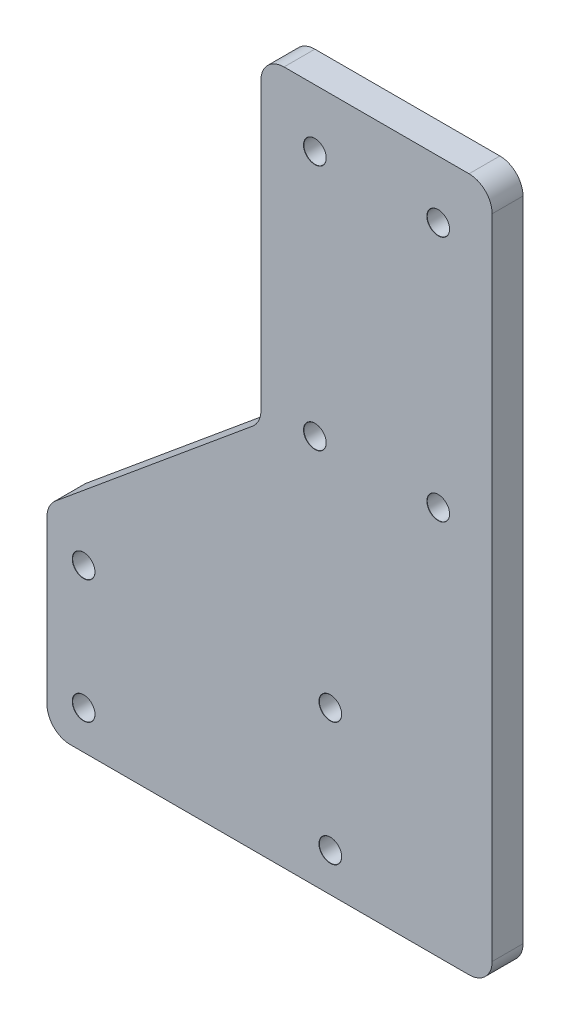
ISO-10303-21;
HEADER;
FILE_DESCRIPTION(('STEP AP214'),'2;1');
FILE_NAME('part.step','',(''),(''),'','','');
FILE_SCHEMA(('AUTOMOTIVE_DESIGN { 1 0 10303 214 1 1 1 1 }'));
ENDSEC;
DATA;
#1=APPLICATION_CONTEXT('core data for automotive mechanical design processes');
#2=APPLICATION_PROTOCOL_DEFINITION('international standard','automotive_design',2000,#1);
#3=PRODUCT_CONTEXT('',#1,'mechanical');
#4=PRODUCT('Part','Part','',(#3));
#5=PRODUCT_RELATED_PRODUCT_CATEGORY('part','',(#4));
#6=PRODUCT_DEFINITION_FORMATION('','',#4);
#7=PRODUCT_DEFINITION_CONTEXT('part definition',#1,'design');
#8=PRODUCT_DEFINITION('design','',#6,#7);
#9=PRODUCT_DEFINITION_SHAPE('','',#8);
#10=(LENGTH_UNIT() NAMED_UNIT(*) SI_UNIT(.MILLI.,.METRE.));
#11=(NAMED_UNIT(*) PLANE_ANGLE_UNIT() SI_UNIT($,.RADIAN.));
#12=(NAMED_UNIT(*) SI_UNIT($,.STERADIAN.) SOLID_ANGLE_UNIT());
#13=UNCERTAINTY_MEASURE_WITH_UNIT(LENGTH_MEASURE(1.E-05),#10,'distance_accuracy_value','');
#14=(GEOMETRIC_REPRESENTATION_CONTEXT(3) GLOBAL_UNCERTAINTY_ASSIGNED_CONTEXT((#13)) GLOBAL_UNIT_ASSIGNED_CONTEXT((#10,
#11,#12)) REPRESENTATION_CONTEXT('',''));
#15=CARTESIAN_POINT('',(0.,0.,0.));
#16=DIRECTION('',(0.,0.,1.));
#17=DIRECTION('',(1.,0.,0.));
#18=AXIS2_PLACEMENT_3D('',#15,#16,#17);
#19=CARTESIAN_POINT('',(16.2499999999986,90.,4.));
#20=DIRECTION('',(-1.,0.,0.));
#21=DIRECTION('',(0.,-1.,0.));
#22=AXIS2_PLACEMENT_3D('',#19,#20,#21);
#23=PLANE('',#22);
#24=DIRECTION('',(0.,1.,0.));
#25=VECTOR('',#24,1.);
#26=CARTESIAN_POINT('',(16.2499999999986,90.,4.));
#27=LINE('',#26,#25);
#28=CARTESIAN_POINT('',(16.2499999999987,3.00000000000003,4.));
#29=VERTEX_POINT('',#28);
#30=CARTESIAN_POINT('',(16.2499999999986,87.,4.));
#31=VERTEX_POINT('',#30);
#32=EDGE_CURVE('E150',#29,#31,#27,.T.);
#33=ORIENTED_EDGE('',*,*,#32,.F.);
#34=DIRECTION('',(0.,0.,-1.));
#35=VECTOR('',#34,1.);
#36=CARTESIAN_POINT('',(16.2499999999987,3.,4.));
#37=LINE('',#36,#35);
#38=CARTESIAN_POINT('',(16.2499999999987,3.00000000000003,0.));
#39=VERTEX_POINT('',#38);
#40=EDGE_CURVE('E135',#29,#39,#37,.T.);
#41=ORIENTED_EDGE('',*,*,#40,.T.);
#42=DIRECTION('',(0.,1.,0.));
#43=VECTOR('',#42,1.);
#44=CARTESIAN_POINT('',(16.2499999999986,90.,0.));
#45=LINE('',#44,#43);
#46=CARTESIAN_POINT('',(16.2499999999986,87.,0.));
#47=VERTEX_POINT('',#46);
#48=EDGE_CURVE('E147',#39,#47,#45,.T.);
#49=ORIENTED_EDGE('',*,*,#48,.T.);
#50=DIRECTION('',(0.,0.,-1.));
#51=VECTOR('',#50,1.);
#52=CARTESIAN_POINT('',(16.2499999999986,87.,4.));
#53=LINE('',#52,#51);
#54=EDGE_CURVE('E152',#47,#31,#53,.F.);
#55=ORIENTED_EDGE('',*,*,#54,.T.);
#56=EDGE_LOOP('',(#33,#41,#49,#55));
#57=FACE_BOUND('',#56,.T.);
#58=ADVANCED_FACE('F41',(#57),#23,.F.);
#59=CARTESIAN_POINT('',(-13.7500000000013,90.,4.));
#60=DIRECTION('',(0.,-1.,0.));
#61=DIRECTION('',(0.,0.,-1.));
#62=AXIS2_PLACEMENT_3D('',#59,#60,#61);
#63=PLANE('',#62);
#64=DIRECTION('',(-1.,0.,0.));
#65=VECTOR('',#64,1.);
#66=CARTESIAN_POINT('',(-13.7500000000013,90.,0.));
#67=LINE('',#66,#65);
#68=CARTESIAN_POINT('',(13.2499999999987,90.,0.));
#69=VERTEX_POINT('',#68);
#70=CARTESIAN_POINT('',(-10.7500000000013,90.,0.));
#71=VERTEX_POINT('',#70);
#72=EDGE_CURVE('E156',#69,#71,#67,.T.);
#73=ORIENTED_EDGE('',*,*,#72,.T.);
#74=DIRECTION('',(0.,0.,-1.));
#75=VECTOR('',#74,1.);
#76=CARTESIAN_POINT('',(-10.7500000000013,90.,4.));
#77=LINE('',#76,#75);
#78=CARTESIAN_POINT('',(-10.7500000000013,90.,4.));
#79=VERTEX_POINT('',#78);
#80=EDGE_CURVE('E215',#71,#79,#77,.F.);
#81=ORIENTED_EDGE('',*,*,#80,.T.);
#82=DIRECTION('',(-1.,0.,0.));
#83=VECTOR('',#82,1.);
#84=CARTESIAN_POINT('',(-13.7500000000013,90.,4.));
#85=LINE('',#84,#83);
#86=CARTESIAN_POINT('',(13.2499999999987,90.,4.));
#87=VERTEX_POINT('',#86);
#88=EDGE_CURVE('E236',#87,#79,#85,.T.);
#89=ORIENTED_EDGE('',*,*,#88,.F.);
#90=DIRECTION('',(0.,0.,-1.));
#91=VECTOR('',#90,1.);
#92=CARTESIAN_POINT('',(13.2499999999987,90.,4.));
#93=LINE('',#92,#91);
#94=EDGE_CURVE('E212',#87,#69,#93,.T.);
#95=ORIENTED_EDGE('',*,*,#94,.T.);
#96=EDGE_LOOP('',(#73,#81,#89,#95));
#97=FACE_BOUND('',#96,.T.);
#98=ADVANCED_FACE('F349',(#97),#63,.F.);
#99=CARTESIAN_POINT('',(-13.7500000000013,48.5,4.));
#100=DIRECTION('',(1.,0.,0.));
#101=DIRECTION('',(0.,0.,-1.));
#102=AXIS2_PLACEMENT_3D('',#99,#100,#101);
#103=PLANE('',#102);
#104=DIRECTION('',(0.,-1.,0.));
#105=VECTOR('',#104,1.);
#106=CARTESIAN_POINT('',(-13.7500000000013,48.5,0.));
#107=LINE('',#106,#105);
#108=CARTESIAN_POINT('',(-13.7500000000013,87.,0.));
#109=VERTEX_POINT('',#108);
#110=CARTESIAN_POINT('',(-13.7500000000013,49.9100010404382,0.));
#111=VERTEX_POINT('',#110);
#112=EDGE_CURVE('E160',#109,#111,#107,.T.);
#113=ORIENTED_EDGE('',*,*,#112,.T.);
#114=DIRECTION('',(0.,0.,-1.));
#115=VECTOR('',#114,1.);
#116=CARTESIAN_POINT('',(-13.7500000000013,49.9100010404382,4.));
#117=LINE('',#116,#115);
#118=CARTESIAN_POINT('',(-13.7500000000013,49.9100010404382,4.));
#119=VERTEX_POINT('',#118);
#120=EDGE_CURVE('E210',#111,#119,#117,.F.);
#121=ORIENTED_EDGE('',*,*,#120,.T.);
#122=DIRECTION('',(0.,-1.,0.));
#123=VECTOR('',#122,1.);
#124=CARTESIAN_POINT('',(-13.7500000000013,48.5,4.));
#125=LINE('',#124,#123);
#126=CARTESIAN_POINT('',(-13.7500000000013,87.,4.));
#127=VERTEX_POINT('',#126);
#128=EDGE_CURVE('E232',#127,#119,#125,.T.);
#129=ORIENTED_EDGE('',*,*,#128,.F.);
#130=DIRECTION('',(0.,0.,-1.));
#131=VECTOR('',#130,1.);
#132=CARTESIAN_POINT('',(-13.7500000000013,87.,4.));
#133=LINE('',#132,#131);
#134=EDGE_CURVE('E207',#127,#109,#133,.T.);
#135=ORIENTED_EDGE('',*,*,#134,.T.);
#136=EDGE_LOOP('',(#113,#121,#129,#135));
#137=FACE_BOUND('',#136,.T.);
#138=ADVANCED_FACE('F222',(#137),#103,.F.);
#139=CARTESIAN_POINT('',(-41.5,25.5,4.));
#140=DIRECTION('',(0.638135364043884,-0.769924189226822,0.));
#141=DIRECTION('',(0.769924189226822,0.638135364043884,0.));
#142=AXIS2_PLACEMENT_3D('',#139,#140,#141);
#143=PLANE('',#142);
#144=DIRECTION('',(-0.769924189226822,-0.638135364043884,0.));
#145=VECTOR('',#144,1.);
#146=CARTESIAN_POINT('',(-41.5,25.5,0.));
#147=LINE('',#146,#145);
#148=CARTESIAN_POINT('',(-14.8355939078697,47.6002284727577,0.));
#149=VERTEX_POINT('',#148);
#150=CARTESIAN_POINT('',(-40.4144060921316,26.3997715272423,0.));
#151=VERTEX_POINT('',#150);
#152=EDGE_CURVE('E171',#149,#151,#147,.T.);
#153=ORIENTED_EDGE('',*,*,#152,.T.);
#154=DIRECTION('',(0.,0.,-1.));
#155=VECTOR('',#154,1.);
#156=CARTESIAN_POINT('',(-40.4144060921316,26.3997715272423,4.));
#157=LINE('',#156,#155);
#158=CARTESIAN_POINT('',(-40.4144060921316,26.3997715272423,4.));
#159=VERTEX_POINT('',#158);
#160=EDGE_CURVE('E205',#151,#159,#157,.F.);
#161=ORIENTED_EDGE('',*,*,#160,.T.);
#162=DIRECTION('',(-0.769924189226822,-0.638135364043884,0.));
#163=VECTOR('',#162,1.);
#164=CARTESIAN_POINT('',(-41.5,25.5,4.));
#165=LINE('',#164,#163);
#166=CARTESIAN_POINT('',(-14.8355939078697,47.6002284727577,4.));
#167=VERTEX_POINT('',#166);
#168=EDGE_CURVE('E231',#167,#159,#165,.T.);
#169=ORIENTED_EDGE('',*,*,#168,.F.);
#170=DIRECTION('',(0.,0.,-1.));
#171=VECTOR('',#170,1.);
#172=CARTESIAN_POINT('',(-14.8355939078697,47.6002284727577,0.));
#173=LINE('',#172,#171);
#174=EDGE_CURVE('E202',#167,#149,#173,.T.);
#175=ORIENTED_EDGE('',*,*,#174,.T.);
#176=EDGE_LOOP('',(#153,#161,#169,#175));
#177=FACE_BOUND('',#176,.T.);
#178=ADVANCED_FACE('F234',(#177),#143,.F.);
#179=CARTESIAN_POINT('',(-41.5,0.,4.));
#180=DIRECTION('',(1.,0.,0.));
#181=DIRECTION('',(0.,0.,-1.));
#182=AXIS2_PLACEMENT_3D('',#179,#180,#181);
#183=PLANE('',#182);
#184=DIRECTION('',(0.,-1.,0.));
#185=VECTOR('',#184,1.);
#186=CARTESIAN_POINT('',(-41.5,0.,0.));
#187=LINE('',#186,#185);
#188=CARTESIAN_POINT('',(-41.5,24.0899989595618,0.));
#189=VERTEX_POINT('',#188);
#190=CARTESIAN_POINT('',(-41.5,3.,0.));
#191=VERTEX_POINT('',#190);
#192=EDGE_CURVE('E174',#189,#191,#187,.T.);
#193=ORIENTED_EDGE('',*,*,#192,.T.);
#194=DIRECTION('',(0.,0.,-1.));
#195=VECTOR('',#194,1.);
#196=CARTESIAN_POINT('',(-41.5,3.,4.));
#197=LINE('',#196,#195);
#198=CARTESIAN_POINT('',(-41.5,3.,4.));
#199=VERTEX_POINT('',#198);
#200=EDGE_CURVE('E56',#191,#199,#197,.F.);
#201=ORIENTED_EDGE('',*,*,#200,.T.);
#202=DIRECTION('',(0.,-1.,0.));
#203=VECTOR('',#202,1.);
#204=CARTESIAN_POINT('',(-41.5,0.,4.));
#205=LINE('',#204,#203);
#206=CARTESIAN_POINT('',(-41.5,24.0899989595618,4.));
#207=VERTEX_POINT('',#206);
#208=EDGE_CURVE('E166',#207,#199,#205,.T.);
#209=ORIENTED_EDGE('',*,*,#208,.F.);
#210=DIRECTION('',(0.,0.,-1.));
#211=VECTOR('',#210,1.);
#212=CARTESIAN_POINT('',(-41.5,24.0899989595618,4.));
#213=LINE('',#212,#211);
#214=EDGE_CURVE('E198',#207,#189,#213,.T.);
#215=ORIENTED_EDGE('',*,*,#214,.T.);
#216=EDGE_LOOP('',(#193,#201,#209,#215));
#217=FACE_BOUND('',#216,.T.);
#218=ADVANCED_FACE('F387',(#217),#183,.F.);
#219=CARTESIAN_POINT('',(0.,0.,4.));
#220=DIRECTION('',(0.,1.,0.));
#221=DIRECTION('',(-1.,0.,0.));
#222=AXIS2_PLACEMENT_3D('',#219,#220,#221);
#223=PLANE('',#222);
#224=DIRECTION('',(1.,0.,0.));
#225=VECTOR('',#224,1.);
#226=CARTESIAN_POINT('',(0.,0.,0.));
#227=LINE('',#226,#225);
#228=CARTESIAN_POINT('',(-38.5,0.,0.));
#229=VERTEX_POINT('',#228);
#230=CARTESIAN_POINT('',(13.2499999999987,0.,0.));
#231=VERTEX_POINT('',#230);
#232=EDGE_CURVE('E176',#229,#231,#227,.T.);
#233=ORIENTED_EDGE('',*,*,#232,.T.);
#234=DIRECTION('',(0.,0.,-1.));
#235=VECTOR('',#234,1.);
#236=CARTESIAN_POINT('',(13.2499999999987,0.,4.));
#237=LINE('',#236,#235);
#238=CARTESIAN_POINT('',(13.2499999999987,0.,4.));
#239=VERTEX_POINT('',#238);
#240=EDGE_CURVE('E136',#231,#239,#237,.F.);
#241=ORIENTED_EDGE('',*,*,#240,.T.);
#242=DIRECTION('',(1.,0.,0.));
#243=VECTOR('',#242,1.);
#244=CARTESIAN_POINT('',(0.,0.,4.));
#245=LINE('',#244,#243);
#246=CARTESIAN_POINT('',(-38.5,0.,4.));
#247=VERTEX_POINT('',#246);
#248=EDGE_CURVE('E178',#247,#239,#245,.T.);
#249=ORIENTED_EDGE('',*,*,#248,.F.);
#250=DIRECTION('',(0.,0.,-1.));
#251=VECTOR('',#250,1.);
#252=CARTESIAN_POINT('',(-38.5,0.,4.));
#253=LINE('',#252,#251);
#254=EDGE_CURVE('E141',#247,#229,#253,.T.);
#255=ORIENTED_EDGE('',*,*,#254,.T.);
#256=EDGE_LOOP('',(#233,#241,#249,#255));
#257=FACE_BOUND('',#256,.T.);
#258=ADVANCED_FACE('F316',(#257),#223,.F.);
#259=CARTESIAN_POINT('',(0.,0.,4.));
#260=DIRECTION('',(0.,0.,-1.));
#261=DIRECTION('',(-1.,0.,0.));
#262=AXIS2_PLACEMENT_3D('',#259,#260,#261);
#263=PLANE('',#262);
#264=CARTESIAN_POINT('',(-36.75,5.,4.));
#265=DIRECTION('',(0.,0.,1.));
#266=DIRECTION('',(1.,0.,0.));
#267=AXIS2_PLACEMENT_3D('',#264,#265,#266);
#268=CIRCLE('',#267,1.475);
#269=CARTESIAN_POINT('',(-35.275,5.,4.));
#270=VERTEX_POINT('',#269);
#271=EDGE_CURVE('E308',#270,#270,#268,.T.);
#272=ORIENTED_EDGE('',*,*,#271,.F.);
#273=EDGE_LOOP('',(#272));
#274=FACE_BOUND('',#273,.T.);
#275=CARTESIAN_POINT('',(-36.75,21.,4.));
#276=DIRECTION('',(0.,0.,1.));
#277=DIRECTION('',(1.,0.,0.));
#278=AXIS2_PLACEMENT_3D('',#275,#276,#277);
#279=CIRCLE('',#278,1.475);
#280=CARTESIAN_POINT('',(-35.275,21.,4.));
#281=VERTEX_POINT('',#280);
#282=EDGE_CURVE('E299',#281,#281,#279,.T.);
#283=ORIENTED_EDGE('',*,*,#282,.F.);
#284=EDGE_LOOP('',(#283));
#285=FACE_BOUND('',#284,.T.);
#286=CARTESIAN_POINT('',(-4.75,5.,4.));
#287=DIRECTION('',(0.,0.,1.));
#288=DIRECTION('',(1.,0.,0.));
#289=AXIS2_PLACEMENT_3D('',#286,#287,#288);
#290=CIRCLE('',#289,1.475);
#291=CARTESIAN_POINT('',(-3.275,5.,4.));
#292=VERTEX_POINT('',#291);
#293=EDGE_CURVE('E290',#292,#292,#290,.T.);
#294=ORIENTED_EDGE('',*,*,#293,.F.);
#295=EDGE_LOOP('',(#294));
#296=FACE_BOUND('',#295,.T.);
#297=CARTESIAN_POINT('',(-4.74999999999999,21.,4.));
#298=DIRECTION('',(0.,0.,1.));
#299=DIRECTION('',(1.,0.,0.));
#300=AXIS2_PLACEMENT_3D('',#297,#298,#299);
#301=CIRCLE('',#300,1.475);
#302=CARTESIAN_POINT('',(-3.27499999999999,21.,4.));
#303=VERTEX_POINT('',#302);
#304=EDGE_CURVE('E281',#303,#303,#301,.T.);
#305=ORIENTED_EDGE('',*,*,#304,.F.);
#306=EDGE_LOOP('',(#305));
#307=FACE_BOUND('',#306,.T.);
#308=CARTESIAN_POINT('',(-6.75000000000004,82.5,4.));
#309=DIRECTION('',(0.,0.,1.));
#310=DIRECTION('',(1.,0.,0.));
#311=AXIS2_PLACEMENT_3D('',#308,#309,#310);
#312=CIRCLE('',#311,1.475);
#313=CARTESIAN_POINT('',(-5.27500000000004,82.5,4.));
#314=VERTEX_POINT('',#313);
#315=EDGE_CURVE('E272',#314,#314,#312,.T.);
#316=ORIENTED_EDGE('',*,*,#315,.F.);
#317=EDGE_LOOP('',(#316));
#318=FACE_BOUND('',#317,.T.);
#319=CARTESIAN_POINT('',(9.24999999999996,82.5,4.));
#320=DIRECTION('',(0.,0.,1.));
#321=DIRECTION('',(1.,0.,0.));
#322=AXIS2_PLACEMENT_3D('',#319,#320,#321);
#323=CIRCLE('',#322,1.475);
#324=CARTESIAN_POINT('',(10.725,82.5,4.));
#325=VERTEX_POINT('',#324);
#326=EDGE_CURVE('E263',#325,#325,#323,.T.);
#327=ORIENTED_EDGE('',*,*,#326,.F.);
#328=EDGE_LOOP('',(#327));
#329=FACE_BOUND('',#328,.T.);
#330=CARTESIAN_POINT('',(-6.75000000000003,50.5,4.));
#331=DIRECTION('',(0.,0.,1.));
#332=DIRECTION('',(1.,0.,0.));
#333=AXIS2_PLACEMENT_3D('',#330,#331,#332);
#334=CIRCLE('',#333,1.475);
#335=CARTESIAN_POINT('',(-5.27500000000003,50.5,4.));
#336=VERTEX_POINT('',#335);
#337=EDGE_CURVE('E254',#336,#336,#334,.T.);
#338=ORIENTED_EDGE('',*,*,#337,.F.);
#339=EDGE_LOOP('',(#338));
#340=FACE_BOUND('',#339,.T.);
#341=CARTESIAN_POINT('',(9.24999999999997,50.5,4.));
#342=DIRECTION('',(0.,0.,1.));
#343=DIRECTION('',(1.,0.,0.));
#344=AXIS2_PLACEMENT_3D('',#341,#342,#343);
#345=CIRCLE('',#344,1.475);
#346=CARTESIAN_POINT('',(10.725,50.5,4.));
#347=VERTEX_POINT('',#346);
#348=EDGE_CURVE('E245',#347,#347,#345,.T.);
#349=ORIENTED_EDGE('',*,*,#348,.F.);
#350=EDGE_LOOP('',(#349));
#351=FACE_BOUND('',#350,.T.);
#352=ORIENTED_EDGE('',*,*,#248,.T.);
#353=CARTESIAN_POINT('',(13.2499999999987,3.,4.));
#354=DIRECTION('',(0.,0.,-1.));
#355=DIRECTION('',(-1.,0.,0.));
#356=AXIS2_PLACEMENT_3D('',#353,#354,#355);
#357=CIRCLE('',#356,3.);
#358=EDGE_CURVE('E196',#239,#29,#357,.F.);
#359=ORIENTED_EDGE('',*,*,#358,.T.);
#360=ORIENTED_EDGE('',*,*,#32,.T.);
#361=CARTESIAN_POINT('',(13.2499999999987,87.,4.));
#362=DIRECTION('',(0.,0.,-1.));
#363=DIRECTION('',(-1.,0.,0.));
#364=AXIS2_PLACEMENT_3D('',#361,#362,#363);
#365=CIRCLE('',#364,3.);
#366=EDGE_CURVE('E189',#31,#87,#365,.F.);
#367=ORIENTED_EDGE('',*,*,#366,.T.);
#368=ORIENTED_EDGE('',*,*,#88,.T.);
#369=CARTESIAN_POINT('',(-10.7500000000013,87.,4.));
#370=DIRECTION('',(0.,0.,-1.));
#371=DIRECTION('',(-1.,0.,0.));
#372=AXIS2_PLACEMENT_3D('',#369,#370,#371);
#373=CIRCLE('',#372,3.);
#374=EDGE_CURVE('E191',#79,#127,#373,.F.);
#375=ORIENTED_EDGE('',*,*,#374,.T.);
#376=ORIENTED_EDGE('',*,*,#128,.T.);
#377=CARTESIAN_POINT('',(-16.7500000000014,49.9100010404382,4.));
#378=DIRECTION('',(0.,0.,-1.));
#379=DIRECTION('',(-1.,0.,0.));
#380=AXIS2_PLACEMENT_3D('',#377,#378,#379);
#381=CIRCLE('',#380,3.);
#382=EDGE_CURVE('E11',#119,#167,#381,.T.);
#383=ORIENTED_EDGE('',*,*,#382,.T.);
#384=ORIENTED_EDGE('',*,*,#168,.T.);
#385=CARTESIAN_POINT('',(-38.5,24.0899989595618,4.));
#386=DIRECTION('',(0.,0.,-1.));
#387=DIRECTION('',(-1.,0.,0.));
#388=AXIS2_PLACEMENT_3D('',#385,#386,#387);
#389=CIRCLE('',#388,3.);
#390=EDGE_CURVE('E63',#159,#207,#389,.F.);
#391=ORIENTED_EDGE('',*,*,#390,.T.);
#392=ORIENTED_EDGE('',*,*,#208,.T.);
#393=CARTESIAN_POINT('',(-38.5,3.,4.));
#394=DIRECTION('',(0.,0.,-1.));
#395=DIRECTION('',(-1.,0.,0.));
#396=AXIS2_PLACEMENT_3D('',#393,#394,#395);
#397=CIRCLE('',#396,3.);
#398=EDGE_CURVE('E194',#199,#247,#397,.F.);
#399=ORIENTED_EDGE('',*,*,#398,.T.);
#400=EDGE_LOOP('',(#352,#359,#360,#367,#368,#375,#376,#383,#384,#391,#392,#399));
#401=FACE_BOUND('',#400,.T.);
#402=ADVANCED_FACE('F230',(#274,#285,#296,#307,#318,#329,#340,#351,#401),#263,.F.);
#403=CARTESIAN_POINT('',(0.,0.,0.));
#404=DIRECTION('',(0.,0.,-1.));
#405=DIRECTION('',(-1.,0.,0.));
#406=AXIS2_PLACEMENT_3D('',#403,#404,#405);
#407=PLANE('',#406);
#408=CARTESIAN_POINT('',(-36.75,5.,0.));
#409=DIRECTION('',(0.,0.,1.));
#410=DIRECTION('',(1.,0.,0.));
#411=AXIS2_PLACEMENT_3D('',#408,#409,#410);
#412=CIRCLE('',#411,1.45);
#413=CARTESIAN_POINT('',(-35.3,5.,0.));
#414=VERTEX_POINT('',#413);
#415=EDGE_CURVE('E302',#414,#414,#412,.T.);
#416=ORIENTED_EDGE('',*,*,#415,.T.);
#417=EDGE_LOOP('',(#416));
#418=FACE_BOUND('',#417,.T.);
#419=CARTESIAN_POINT('',(-36.75,21.,0.));
#420=DIRECTION('',(0.,0.,1.));
#421=DIRECTION('',(1.,0.,0.));
#422=AXIS2_PLACEMENT_3D('',#419,#420,#421);
#423=CIRCLE('',#422,1.45);
#424=CARTESIAN_POINT('',(-35.3,21.,0.));
#425=VERTEX_POINT('',#424);
#426=EDGE_CURVE('E293',#425,#425,#423,.T.);
#427=ORIENTED_EDGE('',*,*,#426,.T.);
#428=EDGE_LOOP('',(#427));
#429=FACE_BOUND('',#428,.T.);
#430=CARTESIAN_POINT('',(-4.75,5.,0.));
#431=DIRECTION('',(0.,0.,1.));
#432=DIRECTION('',(1.,0.,0.));
#433=AXIS2_PLACEMENT_3D('',#430,#431,#432);
#434=CIRCLE('',#433,1.45);
#435=CARTESIAN_POINT('',(-3.3,5.,0.));
#436=VERTEX_POINT('',#435);
#437=EDGE_CURVE('E284',#436,#436,#434,.T.);
#438=ORIENTED_EDGE('',*,*,#437,.T.);
#439=EDGE_LOOP('',(#438));
#440=FACE_BOUND('',#439,.T.);
#441=CARTESIAN_POINT('',(-4.74999999999999,21.,0.));
#442=DIRECTION('',(0.,0.,1.));
#443=DIRECTION('',(1.,0.,0.));
#444=AXIS2_PLACEMENT_3D('',#441,#442,#443);
#445=CIRCLE('',#444,1.45);
#446=CARTESIAN_POINT('',(-3.29999999999999,21.,0.));
#447=VERTEX_POINT('',#446);
#448=EDGE_CURVE('E275',#447,#447,#445,.T.);
#449=ORIENTED_EDGE('',*,*,#448,.T.);
#450=EDGE_LOOP('',(#449));
#451=FACE_BOUND('',#450,.T.);
#452=CARTESIAN_POINT('',(-6.75000000000004,82.5,0.));
#453=DIRECTION('',(0.,0.,1.));
#454=DIRECTION('',(1.,0.,0.));
#455=AXIS2_PLACEMENT_3D('',#452,#453,#454);
#456=CIRCLE('',#455,1.45);
#457=CARTESIAN_POINT('',(-5.30000000000004,82.5,0.));
#458=VERTEX_POINT('',#457);
#459=EDGE_CURVE('E266',#458,#458,#456,.T.);
#460=ORIENTED_EDGE('',*,*,#459,.T.);
#461=EDGE_LOOP('',(#460));
#462=FACE_BOUND('',#461,.T.);
#463=CARTESIAN_POINT('',(9.24999999999996,82.5,0.));
#464=DIRECTION('',(0.,0.,1.));
#465=DIRECTION('',(1.,0.,0.));
#466=AXIS2_PLACEMENT_3D('',#463,#464,#465);
#467=CIRCLE('',#466,1.45);
#468=CARTESIAN_POINT('',(10.7,82.5,0.));
#469=VERTEX_POINT('',#468);
#470=EDGE_CURVE('E257',#469,#469,#467,.T.);
#471=ORIENTED_EDGE('',*,*,#470,.T.);
#472=EDGE_LOOP('',(#471));
#473=FACE_BOUND('',#472,.T.);
#474=CARTESIAN_POINT('',(-6.75000000000003,50.5,0.));
#475=DIRECTION('',(0.,0.,1.));
#476=DIRECTION('',(1.,0.,0.));
#477=AXIS2_PLACEMENT_3D('',#474,#475,#476);
#478=CIRCLE('',#477,1.45);
#479=CARTESIAN_POINT('',(-5.30000000000004,50.5,0.));
#480=VERTEX_POINT('',#479);
#481=EDGE_CURVE('E248',#480,#480,#478,.T.);
#482=ORIENTED_EDGE('',*,*,#481,.T.);
#483=EDGE_LOOP('',(#482));
#484=FACE_BOUND('',#483,.T.);
#485=CARTESIAN_POINT('',(9.24999999999997,50.5,0.));
#486=DIRECTION('',(0.,0.,1.));
#487=DIRECTION('',(1.,0.,0.));
#488=AXIS2_PLACEMENT_3D('',#485,#486,#487);
#489=CIRCLE('',#488,1.45);
#490=CARTESIAN_POINT('',(10.7,50.5,0.));
#491=VERTEX_POINT('',#490);
#492=EDGE_CURVE('E157',#491,#491,#489,.T.);
#493=ORIENTED_EDGE('',*,*,#492,.T.);
#494=EDGE_LOOP('',(#493));
#495=FACE_BOUND('',#494,.T.);
#496=ORIENTED_EDGE('',*,*,#48,.F.);
#497=CARTESIAN_POINT('',(13.2499999999987,3.,0.));
#498=DIRECTION('',(0.,0.,-1.));
#499=DIRECTION('',(-1.,0.,0.));
#500=AXIS2_PLACEMENT_3D('',#497,#498,#499);
#501=CIRCLE('',#500,3.);
#502=EDGE_CURVE('E131',#39,#231,#501,.T.);
#503=ORIENTED_EDGE('',*,*,#502,.T.);
#504=ORIENTED_EDGE('',*,*,#232,.F.);
#505=CARTESIAN_POINT('',(-38.5,3.,0.));
#506=DIRECTION('',(0.,0.,-1.));
#507=DIRECTION('',(-1.,0.,0.));
#508=AXIS2_PLACEMENT_3D('',#505,#506,#507);
#509=CIRCLE('',#508,3.);
#510=EDGE_CURVE('E142',#229,#191,#509,.T.);
#511=ORIENTED_EDGE('',*,*,#510,.T.);
#512=ORIENTED_EDGE('',*,*,#192,.F.);
#513=CARTESIAN_POINT('',(-38.5,24.0899989595618,0.));
#514=DIRECTION('',(0.,0.,-1.));
#515=DIRECTION('',(-1.,0.,0.));
#516=AXIS2_PLACEMENT_3D('',#513,#514,#515);
#517=CIRCLE('',#516,3.);
#518=EDGE_CURVE('E183',#189,#151,#517,.T.);
#519=ORIENTED_EDGE('',*,*,#518,.T.);
#520=ORIENTED_EDGE('',*,*,#152,.F.);
#521=CARTESIAN_POINT('',(-16.7500000000014,49.9100010404382,0.));
#522=DIRECTION('',(0.,0.,-1.));
#523=DIRECTION('',(-1.,0.,0.));
#524=AXIS2_PLACEMENT_3D('',#521,#522,#523);
#525=CIRCLE('',#524,3.);
#526=EDGE_CURVE('E49',#149,#111,#525,.F.);
#527=ORIENTED_EDGE('',*,*,#526,.T.);
#528=ORIENTED_EDGE('',*,*,#112,.F.);
#529=CARTESIAN_POINT('',(-10.7500000000013,87.,0.));
#530=DIRECTION('',(0.,0.,-1.));
#531=DIRECTION('',(-1.,0.,0.));
#532=AXIS2_PLACEMENT_3D('',#529,#530,#531);
#533=CIRCLE('',#532,3.);
#534=EDGE_CURVE('E181',#109,#71,#533,.T.);
#535=ORIENTED_EDGE('',*,*,#534,.T.);
#536=ORIENTED_EDGE('',*,*,#72,.F.);
#537=CARTESIAN_POINT('',(13.2499999999987,87.,0.));
#538=DIRECTION('',(0.,0.,-1.));
#539=DIRECTION('',(-1.,0.,0.));
#540=AXIS2_PLACEMENT_3D('',#537,#538,#539);
#541=CIRCLE('',#540,3.);
#542=EDGE_CURVE('E151',#69,#47,#541,.T.);
#543=ORIENTED_EDGE('',*,*,#542,.T.);
#544=EDGE_LOOP('',(#496,#503,#504,#511,#512,#519,#520,#527,#528,#535,#536,#543));
#545=FACE_BOUND('',#544,.T.);
#546=ADVANCED_FACE('F154',(#418,#429,#440,#451,#462,#473,#484,#495,#545),#407,.T.);
#547=CARTESIAN_POINT('',(9.24999999999997,50.5,4.));
#548=DIRECTION('',(0.,0.,1.));
#549=DIRECTION('',(1.,0.,0.));
#550=AXIS2_PLACEMENT_3D('',#547,#548,#549);
#551=CYLINDRICAL_SURFACE('',#550,1.45);
#552=ORIENTED_EDGE('',*,*,#492,.F.);
#553=EDGE_LOOP('',(#552));
#554=FACE_BOUND('',#553,.T.);
#555=CARTESIAN_POINT('',(9.24999999999997,50.5,3.975));
#556=DIRECTION('',(0.,0.,1.));
#557=DIRECTION('',(1.,0.,0.));
#558=AXIS2_PLACEMENT_3D('',#555,#556,#557);
#559=CIRCLE('',#558,1.45);
#560=CARTESIAN_POINT('',(10.7,50.5,3.975));
#561=VERTEX_POINT('',#560);
#562=EDGE_CURVE('E163',#561,#561,#559,.T.);
#563=ORIENTED_EDGE('',*,*,#562,.T.);
#564=EDGE_LOOP('',(#563));
#565=FACE_BOUND('',#564,.T.);
#566=ADVANCED_FACE('F335',(#554,#565),#551,.F.);
#567=CARTESIAN_POINT('',(9.24999999999997,50.5,4.));
#568=DIRECTION('',(0.,0.,1.));
#569=DIRECTION('',(1.,0.,0.));
#570=AXIS2_PLACEMENT_3D('',#567,#568,#569);
#571=CONICAL_SURFACE('',#570,1.475,0.785398163397466);
#572=ORIENTED_EDGE('',*,*,#562,.F.);
#573=EDGE_LOOP('',(#572));
#574=FACE_BOUND('',#573,.T.);
#575=ORIENTED_EDGE('',*,*,#348,.T.);
#576=EDGE_LOOP('',(#575));
#577=FACE_BOUND('',#576,.T.);
#578=ADVANCED_FACE('F332',(#574,#577),#571,.F.);
#579=CARTESIAN_POINT('',(-6.75000000000003,50.5,4.));
#580=DIRECTION('',(0.,0.,1.));
#581=DIRECTION('',(1.,0.,0.));
#582=AXIS2_PLACEMENT_3D('',#579,#580,#581);
#583=CYLINDRICAL_SURFACE('',#582,1.45);
#584=ORIENTED_EDGE('',*,*,#481,.F.);
#585=EDGE_LOOP('',(#584));
#586=FACE_BOUND('',#585,.T.);
#587=CARTESIAN_POINT('',(-6.75000000000003,50.5,3.975));
#588=DIRECTION('',(0.,0.,1.));
#589=DIRECTION('',(1.,0.,0.));
#590=AXIS2_PLACEMENT_3D('',#587,#588,#589);
#591=CIRCLE('',#590,1.45);
#592=CARTESIAN_POINT('',(-5.30000000000004,50.5,3.975));
#593=VERTEX_POINT('',#592);
#594=EDGE_CURVE('E251',#593,#593,#591,.T.);
#595=ORIENTED_EDGE('',*,*,#594,.T.);
#596=EDGE_LOOP('',(#595));
#597=FACE_BOUND('',#596,.T.);
#598=ADVANCED_FACE('F334',(#586,#597),#583,.F.);
#599=CARTESIAN_POINT('',(-6.75000000000003,50.5,4.));
#600=DIRECTION('',(0.,0.,1.));
#601=DIRECTION('',(1.,0.,0.));
#602=AXIS2_PLACEMENT_3D('',#599,#600,#601);
#603=CONICAL_SURFACE('',#602,1.475,0.785398163397466);
#604=ORIENTED_EDGE('',*,*,#594,.F.);
#605=EDGE_LOOP('',(#604));
#606=FACE_BOUND('',#605,.T.);
#607=ORIENTED_EDGE('',*,*,#337,.T.);
#608=EDGE_LOOP('',(#607));
#609=FACE_BOUND('',#608,.T.);
#610=ADVANCED_FACE('F342',(#606,#609),#603,.F.);
#611=CARTESIAN_POINT('',(9.24999999999996,82.5,4.));
#612=DIRECTION('',(0.,0.,1.));
#613=DIRECTION('',(1.,0.,0.));
#614=AXIS2_PLACEMENT_3D('',#611,#612,#613);
#615=CYLINDRICAL_SURFACE('',#614,1.45);
#616=ORIENTED_EDGE('',*,*,#470,.F.);
#617=EDGE_LOOP('',(#616));
#618=FACE_BOUND('',#617,.T.);
#619=CARTESIAN_POINT('',(9.24999999999996,82.5,3.975));
#620=DIRECTION('',(0.,0.,1.));
#621=DIRECTION('',(1.,0.,0.));
#622=AXIS2_PLACEMENT_3D('',#619,#620,#621);
#623=CIRCLE('',#622,1.45);
#624=CARTESIAN_POINT('',(10.7,82.5,3.975));
#625=VERTEX_POINT('',#624);
#626=EDGE_CURVE('E260',#625,#625,#623,.T.);
#627=ORIENTED_EDGE('',*,*,#626,.T.);
#628=EDGE_LOOP('',(#627));
#629=FACE_BOUND('',#628,.T.);
#630=ADVANCED_FACE('F461',(#618,#629),#615,.F.);
#631=CARTESIAN_POINT('',(9.24999999999996,82.5,4.));
#632=DIRECTION('',(0.,0.,1.));
#633=DIRECTION('',(1.,0.,0.));
#634=AXIS2_PLACEMENT_3D('',#631,#632,#633);
#635=CONICAL_SURFACE('',#634,1.475,0.785398163397466);
#636=ORIENTED_EDGE('',*,*,#626,.F.);
#637=EDGE_LOOP('',(#636));
#638=FACE_BOUND('',#637,.T.);
#639=ORIENTED_EDGE('',*,*,#326,.T.);
#640=EDGE_LOOP('',(#639));
#641=FACE_BOUND('',#640,.T.);
#642=ADVANCED_FACE('F471',(#638,#641),#635,.F.);
#643=CARTESIAN_POINT('',(-6.75000000000004,82.5,4.));
#644=DIRECTION('',(0.,0.,1.));
#645=DIRECTION('',(1.,0.,0.));
#646=AXIS2_PLACEMENT_3D('',#643,#644,#645);
#647=CYLINDRICAL_SURFACE('',#646,1.45);
#648=ORIENTED_EDGE('',*,*,#459,.F.);
#649=EDGE_LOOP('',(#648));
#650=FACE_BOUND('',#649,.T.);
#651=CARTESIAN_POINT('',(-6.75000000000004,82.5,3.975));
#652=DIRECTION('',(0.,0.,1.));
#653=DIRECTION('',(1.,0.,0.));
#654=AXIS2_PLACEMENT_3D('',#651,#652,#653);
#655=CIRCLE('',#654,1.45);
#656=CARTESIAN_POINT('',(-5.30000000000004,82.5,3.975));
#657=VERTEX_POINT('',#656);
#658=EDGE_CURVE('E269',#657,#657,#655,.T.);
#659=ORIENTED_EDGE('',*,*,#658,.T.);
#660=EDGE_LOOP('',(#659));
#661=FACE_BOUND('',#660,.T.);
#662=ADVANCED_FACE('F481',(#650,#661),#647,.F.);
#663=CARTESIAN_POINT('',(-6.75000000000004,82.5,4.));
#664=DIRECTION('',(0.,0.,1.));
#665=DIRECTION('',(1.,0.,0.));
#666=AXIS2_PLACEMENT_3D('',#663,#664,#665);
#667=CONICAL_SURFACE('',#666,1.475,0.785398163397466);
#668=ORIENTED_EDGE('',*,*,#658,.F.);
#669=EDGE_LOOP('',(#668));
#670=FACE_BOUND('',#669,.T.);
#671=ORIENTED_EDGE('',*,*,#315,.T.);
#672=EDGE_LOOP('',(#671));
#673=FACE_BOUND('',#672,.T.);
#674=ADVANCED_FACE('F491',(#670,#673),#667,.F.);
#675=CARTESIAN_POINT('',(-4.74999999999999,21.,4.));
#676=DIRECTION('',(0.,0.,1.));
#677=DIRECTION('',(1.,0.,0.));
#678=AXIS2_PLACEMENT_3D('',#675,#676,#677);
#679=CYLINDRICAL_SURFACE('',#678,1.45);
#680=ORIENTED_EDGE('',*,*,#448,.F.);
#681=EDGE_LOOP('',(#680));
#682=FACE_BOUND('',#681,.T.);
#683=CARTESIAN_POINT('',(-4.74999999999999,21.,3.975));
#684=DIRECTION('',(0.,0.,1.));
#685=DIRECTION('',(1.,0.,0.));
#686=AXIS2_PLACEMENT_3D('',#683,#684,#685);
#687=CIRCLE('',#686,1.45);
#688=CARTESIAN_POINT('',(-3.29999999999999,21.,3.975));
#689=VERTEX_POINT('',#688);
#690=EDGE_CURVE('E278',#689,#689,#687,.T.);
#691=ORIENTED_EDGE('',*,*,#690,.T.);
#692=EDGE_LOOP('',(#691));
#693=FACE_BOUND('',#692,.T.);
#694=ADVANCED_FACE('F501',(#682,#693),#679,.F.);
#695=CARTESIAN_POINT('',(-4.74999999999999,21.,4.));
#696=DIRECTION('',(0.,0.,1.));
#697=DIRECTION('',(1.,0.,0.));
#698=AXIS2_PLACEMENT_3D('',#695,#696,#697);
#699=CONICAL_SURFACE('',#698,1.475,0.785398163397466);
#700=ORIENTED_EDGE('',*,*,#690,.F.);
#701=EDGE_LOOP('',(#700));
#702=FACE_BOUND('',#701,.T.);
#703=ORIENTED_EDGE('',*,*,#304,.T.);
#704=EDGE_LOOP('',(#703));
#705=FACE_BOUND('',#704,.T.);
#706=ADVANCED_FACE('F511',(#702,#705),#699,.F.);
#707=CARTESIAN_POINT('',(-4.75,5.,4.));
#708=DIRECTION('',(0.,0.,1.));
#709=DIRECTION('',(1.,0.,0.));
#710=AXIS2_PLACEMENT_3D('',#707,#708,#709);
#711=CYLINDRICAL_SURFACE('',#710,1.45);
#712=ORIENTED_EDGE('',*,*,#437,.F.);
#713=EDGE_LOOP('',(#712));
#714=FACE_BOUND('',#713,.T.);
#715=CARTESIAN_POINT('',(-4.75,5.,3.975));
#716=DIRECTION('',(0.,0.,1.));
#717=DIRECTION('',(1.,0.,0.));
#718=AXIS2_PLACEMENT_3D('',#715,#716,#717);
#719=CIRCLE('',#718,1.45);
#720=CARTESIAN_POINT('',(-3.3,5.,3.975));
#721=VERTEX_POINT('',#720);
#722=EDGE_CURVE('E287',#721,#721,#719,.T.);
#723=ORIENTED_EDGE('',*,*,#722,.T.);
#724=EDGE_LOOP('',(#723));
#725=FACE_BOUND('',#724,.T.);
#726=ADVANCED_FACE('F521',(#714,#725),#711,.F.);
#727=CARTESIAN_POINT('',(-4.75,5.,4.));
#728=DIRECTION('',(0.,0.,1.));
#729=DIRECTION('',(1.,0.,0.));
#730=AXIS2_PLACEMENT_3D('',#727,#728,#729);
#731=CONICAL_SURFACE('',#730,1.475,0.785398163397466);
#732=ORIENTED_EDGE('',*,*,#722,.F.);
#733=EDGE_LOOP('',(#732));
#734=FACE_BOUND('',#733,.T.);
#735=ORIENTED_EDGE('',*,*,#293,.T.);
#736=EDGE_LOOP('',(#735));
#737=FACE_BOUND('',#736,.T.);
#738=ADVANCED_FACE('F531',(#734,#737),#731,.F.);
#739=CARTESIAN_POINT('',(-36.75,21.,4.));
#740=DIRECTION('',(0.,0.,1.));
#741=DIRECTION('',(1.,0.,0.));
#742=AXIS2_PLACEMENT_3D('',#739,#740,#741);
#743=CYLINDRICAL_SURFACE('',#742,1.45);
#744=ORIENTED_EDGE('',*,*,#426,.F.);
#745=EDGE_LOOP('',(#744));
#746=FACE_BOUND('',#745,.T.);
#747=CARTESIAN_POINT('',(-36.75,21.,3.975));
#748=DIRECTION('',(0.,0.,1.));
#749=DIRECTION('',(1.,0.,0.));
#750=AXIS2_PLACEMENT_3D('',#747,#748,#749);
#751=CIRCLE('',#750,1.45);
#752=CARTESIAN_POINT('',(-35.3,21.,3.975));
#753=VERTEX_POINT('',#752);
#754=EDGE_CURVE('E296',#753,#753,#751,.T.);
#755=ORIENTED_EDGE('',*,*,#754,.T.);
#756=EDGE_LOOP('',(#755));
#757=FACE_BOUND('',#756,.T.);
#758=ADVANCED_FACE('F541',(#746,#757),#743,.F.);
#759=CARTESIAN_POINT('',(-36.75,21.,4.));
#760=DIRECTION('',(0.,0.,1.));
#761=DIRECTION('',(1.,0.,0.));
#762=AXIS2_PLACEMENT_3D('',#759,#760,#761);
#763=CONICAL_SURFACE('',#762,1.475,0.785398163397396);
#764=ORIENTED_EDGE('',*,*,#754,.F.);
#765=EDGE_LOOP('',(#764));
#766=FACE_BOUND('',#765,.T.);
#767=ORIENTED_EDGE('',*,*,#282,.T.);
#768=EDGE_LOOP('',(#767));
#769=FACE_BOUND('',#768,.T.);
#770=ADVANCED_FACE('F551',(#766,#769),#763,.F.);
#771=CARTESIAN_POINT('',(-36.75,5.,4.));
#772=DIRECTION('',(0.,0.,1.));
#773=DIRECTION('',(1.,0.,0.));
#774=AXIS2_PLACEMENT_3D('',#771,#772,#773);
#775=CYLINDRICAL_SURFACE('',#774,1.45);
#776=ORIENTED_EDGE('',*,*,#415,.F.);
#777=EDGE_LOOP('',(#776));
#778=FACE_BOUND('',#777,.T.);
#779=CARTESIAN_POINT('',(-36.75,5.,3.975));
#780=DIRECTION('',(0.,0.,1.));
#781=DIRECTION('',(1.,0.,0.));
#782=AXIS2_PLACEMENT_3D('',#779,#780,#781);
#783=CIRCLE('',#782,1.45);
#784=CARTESIAN_POINT('',(-35.3,5.,3.975));
#785=VERTEX_POINT('',#784);
#786=EDGE_CURVE('E305',#785,#785,#783,.T.);
#787=ORIENTED_EDGE('',*,*,#786,.T.);
#788=EDGE_LOOP('',(#787));
#789=FACE_BOUND('',#788,.T.);
#790=ADVANCED_FACE('F561',(#778,#789),#775,.F.);
#791=CARTESIAN_POINT('',(-36.75,5.,4.));
#792=DIRECTION('',(0.,0.,1.));
#793=DIRECTION('',(1.,0.,0.));
#794=AXIS2_PLACEMENT_3D('',#791,#792,#793);
#795=CONICAL_SURFACE('',#794,1.475,0.785398163397396);
#796=ORIENTED_EDGE('',*,*,#786,.F.);
#797=EDGE_LOOP('',(#796));
#798=FACE_BOUND('',#797,.T.);
#799=ORIENTED_EDGE('',*,*,#271,.T.);
#800=EDGE_LOOP('',(#799));
#801=FACE_BOUND('',#800,.T.);
#802=ADVANCED_FACE('F312',(#798,#801),#795,.F.);
#803=CARTESIAN_POINT('',(13.2499999999987,3.,4.));
#804=DIRECTION('',(0.,0.,-1.));
#805=DIRECTION('',(-1.,0.,0.));
#806=AXIS2_PLACEMENT_3D('',#803,#804,#805);
#807=CYLINDRICAL_SURFACE('',#806,3.);
#808=ORIENTED_EDGE('',*,*,#358,.F.);
#809=ORIENTED_EDGE('',*,*,#240,.F.);
#810=ORIENTED_EDGE('',*,*,#502,.F.);
#811=ORIENTED_EDGE('',*,*,#40,.F.);
#812=EDGE_LOOP('',(#808,#809,#810,#811));
#813=FACE_BOUND('',#812,.T.);
#814=ADVANCED_FACE('F134',(#813),#807,.T.);
#815=CARTESIAN_POINT('',(-38.5,3.,4.));
#816=DIRECTION('',(0.,0.,-1.));
#817=DIRECTION('',(-1.,0.,0.));
#818=AXIS2_PLACEMENT_3D('',#815,#816,#817);
#819=CYLINDRICAL_SURFACE('',#818,3.);
#820=ORIENTED_EDGE('',*,*,#398,.F.);
#821=ORIENTED_EDGE('',*,*,#200,.F.);
#822=ORIENTED_EDGE('',*,*,#510,.F.);
#823=ORIENTED_EDGE('',*,*,#254,.F.);
#824=EDGE_LOOP('',(#820,#821,#822,#823));
#825=FACE_BOUND('',#824,.T.);
#826=ADVANCED_FACE('F361',(#825),#819,.T.);
#827=CARTESIAN_POINT('',(-38.5,24.0899989595618,4.));
#828=DIRECTION('',(0.,0.,-1.));
#829=DIRECTION('',(-1.,0.,0.));
#830=AXIS2_PLACEMENT_3D('',#827,#828,#829);
#831=CYLINDRICAL_SURFACE('',#830,3.);
#832=ORIENTED_EDGE('',*,*,#390,.F.);
#833=ORIENTED_EDGE('',*,*,#160,.F.);
#834=ORIENTED_EDGE('',*,*,#518,.F.);
#835=ORIENTED_EDGE('',*,*,#214,.F.);
#836=EDGE_LOOP('',(#832,#833,#834,#835));
#837=FACE_BOUND('',#836,.T.);
#838=ADVANCED_FACE('F364',(#837),#831,.T.);
#839=CARTESIAN_POINT('',(-16.7500000000014,49.9100010404382,4.));
#840=DIRECTION('',(0.,0.,1.));
#841=DIRECTION('',(1.,0.,0.));
#842=AXIS2_PLACEMENT_3D('',#839,#840,#841);
#843=CYLINDRICAL_SURFACE('',#842,3.);
#844=ORIENTED_EDGE('',*,*,#382,.F.);
#845=ORIENTED_EDGE('',*,*,#120,.F.);
#846=ORIENTED_EDGE('',*,*,#526,.F.);
#847=ORIENTED_EDGE('',*,*,#174,.F.);
#848=EDGE_LOOP('',(#844,#845,#846,#847));
#849=FACE_BOUND('',#848,.T.);
#850=ADVANCED_FACE('F227',(#849),#843,.F.);
#851=CARTESIAN_POINT('',(-10.7500000000013,87.,4.));
#852=DIRECTION('',(0.,0.,-1.));
#853=DIRECTION('',(-1.,0.,0.));
#854=AXIS2_PLACEMENT_3D('',#851,#852,#853);
#855=CYLINDRICAL_SURFACE('',#854,3.);
#856=ORIENTED_EDGE('',*,*,#374,.F.);
#857=ORIENTED_EDGE('',*,*,#80,.F.);
#858=ORIENTED_EDGE('',*,*,#534,.F.);
#859=ORIENTED_EDGE('',*,*,#134,.F.);
#860=EDGE_LOOP('',(#856,#857,#858,#859));
#861=FACE_BOUND('',#860,.T.);
#862=ADVANCED_FACE('F370',(#861),#855,.T.);
#863=CARTESIAN_POINT('',(13.2499999999987,87.,4.));
#864=DIRECTION('',(0.,0.,-1.));
#865=DIRECTION('',(-1.,0.,0.));
#866=AXIS2_PLACEMENT_3D('',#863,#864,#865);
#867=CYLINDRICAL_SURFACE('',#866,3.);
#868=ORIENTED_EDGE('',*,*,#366,.F.);
#869=ORIENTED_EDGE('',*,*,#54,.F.);
#870=ORIENTED_EDGE('',*,*,#542,.F.);
#871=ORIENTED_EDGE('',*,*,#94,.F.);
#872=EDGE_LOOP('',(#868,#869,#870,#871));
#873=FACE_BOUND('',#872,.T.);
#874=ADVANCED_FACE('F43',(#873),#867,.T.);
#875=CLOSED_SHELL('',(#58,#98,#138,#178,#218,#258,#402,#546,#566,#578,#598,#610,#630,#642,#662,
#674,#694,#706,#726,#738,#758,#770,#790,#802,#814,#826,#838,#850,#862,#874));
#876=MANIFOLD_SOLID_BREP('B2',#875);
#877=ADVANCED_BREP_SHAPE_REPRESENTATION('',(#18,#876),#14);
#878=SHAPE_DEFINITION_REPRESENTATION(#9,#877);
ENDSEC;
END-ISO-10303-21;
